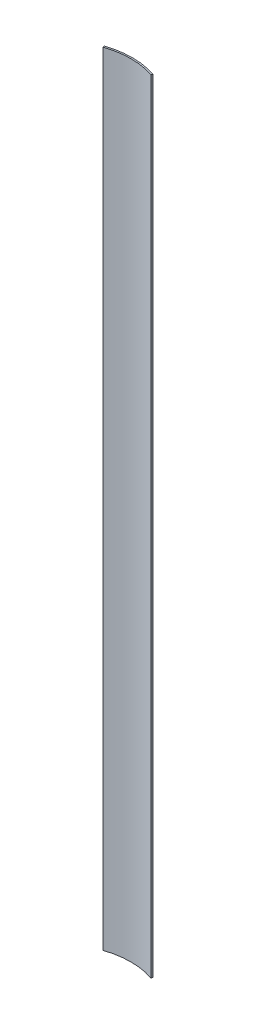
ISO-10303-21;
HEADER;
FILE_DESCRIPTION(('STEP AP214'),'2;1');
FILE_NAME('part.step','',(''),(''),'','','');
FILE_SCHEMA(('AUTOMOTIVE_DESIGN { 1 0 10303 214 1 1 1 1 }'));
ENDSEC;
DATA;
#1=APPLICATION_CONTEXT('core data for automotive mechanical design processes');
#2=APPLICATION_PROTOCOL_DEFINITION('international standard','automotive_design',2000,#1);
#3=PRODUCT_CONTEXT('',#1,'mechanical');
#4=PRODUCT('Part','Part','',(#3));
#5=PRODUCT_RELATED_PRODUCT_CATEGORY('part','',(#4));
#6=PRODUCT_DEFINITION_FORMATION('','',#4);
#7=PRODUCT_DEFINITION_CONTEXT('part definition',#1,'design');
#8=PRODUCT_DEFINITION('design','',#6,#7);
#9=PRODUCT_DEFINITION_SHAPE('','',#8);
#10=(LENGTH_UNIT() NAMED_UNIT(*) SI_UNIT(.MILLI.,.METRE.));
#11=(NAMED_UNIT(*) PLANE_ANGLE_UNIT() SI_UNIT($,.RADIAN.));
#12=(NAMED_UNIT(*) SI_UNIT($,.STERADIAN.) SOLID_ANGLE_UNIT());
#13=UNCERTAINTY_MEASURE_WITH_UNIT(LENGTH_MEASURE(1.E-05),#10,'distance_accuracy_value','');
#14=(GEOMETRIC_REPRESENTATION_CONTEXT(3) GLOBAL_UNCERTAINTY_ASSIGNED_CONTEXT((#13)) GLOBAL_UNIT_ASSIGNED_CONTEXT((#10,
#11,#12)) REPRESENTATION_CONTEXT('',''));
#15=CARTESIAN_POINT('',(0.,0.,0.));
#16=DIRECTION('',(0.,0.,1.));
#17=DIRECTION('',(1.,0.,0.));
#18=AXIS2_PLACEMENT_3D('',#15,#16,#17);
#19=CARTESIAN_POINT('',(0.,200.2,-6.83217682314223E-13));
#20=DIRECTION('',(0.,-1.,0.));
#21=DIRECTION('',(0.,0.,-1.));
#22=AXIS2_PLACEMENT_3D('',#19,#20,#21);
#23=PLANE('',#22);
#24=CARTESIAN_POINT('',(0.,200.2,-6.83217682314223E-13));
#25=DIRECTION('',(0.,-1.,0.));
#26=DIRECTION('',(0.,0.,-1.));
#27=AXIS2_PLACEMENT_3D('',#24,#25,#26);
#28=CIRCLE('',#27,19.45);
#29=CARTESIAN_POINT('',(-6.23779404858429,200.2,-18.4226063684668));
#30=VERTEX_POINT('',#29);
#31=CARTESIAN_POINT('',(6.23779404858429,200.2,-18.4226063684668));
#32=VERTEX_POINT('',#31);
#33=EDGE_CURVE('E76',#30,#32,#28,.T.);
#34=ORIENTED_EDGE('',*,*,#33,.F.);
#35=DIRECTION('',(-0.320709205582791,0.,-0.947177705319575));
#36=VECTOR('',#35,1.);
#37=CARTESIAN_POINT('',(-6.23779404858429,200.2,-18.4226063684668));
#38=LINE('',#37,#36);
#39=CARTESIAN_POINT('',(-6.10951036635117,200.2,-18.0437352863389));
#40=VERTEX_POINT('',#39);
#41=EDGE_CURVE('E64',#40,#30,#38,.T.);
#42=ORIENTED_EDGE('',*,*,#41,.F.);
#43=CARTESIAN_POINT('',(0.,200.2,-6.83217682314223E-13));
#44=DIRECTION('',(0.,1.,0.));
#45=DIRECTION('',(0.,0.,1.));
#46=AXIS2_PLACEMENT_3D('',#43,#44,#45);
#47=CIRCLE('',#46,19.05);
#48=CARTESIAN_POINT('',(6.10951036635118,200.2,-18.0437352863389));
#49=VERTEX_POINT('',#48);
#50=EDGE_CURVE('E69',#49,#40,#47,.T.);
#51=ORIENTED_EDGE('',*,*,#50,.F.);
#52=DIRECTION('',(-0.320709205582791,0.,0.947177705319575));
#53=VECTOR('',#52,1.);
#54=CARTESIAN_POINT('',(6.10951036635117,200.2,-18.0437352863389));
#55=LINE('',#54,#53);
#56=EDGE_CURVE('E73',#32,#49,#55,.T.);
#57=ORIENTED_EDGE('',*,*,#56,.F.);
#58=EDGE_LOOP('',(#34,#42,#51,#57));
#59=FACE_BOUND('',#58,.T.);
#60=ADVANCED_FACE('F34',(#59),#23,.F.);
#61=CARTESIAN_POINT('',(0.,0.,0.));
#62=DIRECTION('',(0.,-1.,0.));
#63=DIRECTION('',(0.,0.,-1.));
#64=AXIS2_PLACEMENT_3D('',#61,#62,#63);
#65=PLANE('',#64);
#66=CARTESIAN_POINT('',(0.,0.,0.));
#67=DIRECTION('',(0.,-1.,0.));
#68=DIRECTION('',(0.,0.,-1.));
#69=AXIS2_PLACEMENT_3D('',#66,#67,#68);
#70=CIRCLE('',#69,19.45);
#71=CARTESIAN_POINT('',(-6.23779404858429,0.,-18.4226063684661));
#72=VERTEX_POINT('',#71);
#73=CARTESIAN_POINT('',(6.23779404858429,0.,-18.4226063684661));
#74=VERTEX_POINT('',#73);
#75=EDGE_CURVE('E90',#72,#74,#70,.T.);
#76=ORIENTED_EDGE('',*,*,#75,.T.);
#77=DIRECTION('',(-0.320709205582791,0.,0.947177705319575));
#78=VECTOR('',#77,1.);
#79=CARTESIAN_POINT('',(6.10951036635117,0.,-18.0437352863382));
#80=LINE('',#79,#78);
#81=CARTESIAN_POINT('',(6.10951036635118,0.,-18.0437352863382));
#82=VERTEX_POINT('',#81);
#83=EDGE_CURVE('E53',#74,#82,#80,.T.);
#84=ORIENTED_EDGE('',*,*,#83,.T.);
#85=CARTESIAN_POINT('',(0.,0.,0.));
#86=DIRECTION('',(0.,1.,0.));
#87=DIRECTION('',(0.,0.,1.));
#88=AXIS2_PLACEMENT_3D('',#85,#86,#87);
#89=CIRCLE('',#88,19.05);
#90=CARTESIAN_POINT('',(-6.10951036635117,0.,-18.0437352863382));
#91=VERTEX_POINT('',#90);
#92=EDGE_CURVE('E47',#82,#91,#89,.T.);
#93=ORIENTED_EDGE('',*,*,#92,.T.);
#94=DIRECTION('',(-0.320709205582791,0.,-0.947177705319575));
#95=VECTOR('',#94,1.);
#96=CARTESIAN_POINT('',(-6.23779404858429,0.,-18.4226063684661));
#97=LINE('',#96,#95);
#98=EDGE_CURVE('E11',#91,#72,#97,.T.);
#99=ORIENTED_EDGE('',*,*,#98,.T.);
#100=EDGE_LOOP('',(#76,#84,#93,#99));
#101=FACE_BOUND('',#100,.T.);
#102=ADVANCED_FACE('F115',(#101),#65,.T.);
#103=CARTESIAN_POINT('',(0.,200.2,-6.83217682314223E-13));
#104=DIRECTION('',(0.,-1.,0.));
#105=DIRECTION('',(0.,0.,-1.));
#106=AXIS2_PLACEMENT_3D('',#103,#104,#105);
#107=CYLINDRICAL_SURFACE('',#106,19.45);
#108=DIRECTION('',(0.,-1.,0.));
#109=VECTOR('',#108,1.);
#110=CARTESIAN_POINT('',(6.23779404858429,200.2,-18.4226063684668));
#111=LINE('',#110,#109);
#112=EDGE_CURVE('E92',#32,#74,#111,.T.);
#113=ORIENTED_EDGE('',*,*,#112,.T.);
#114=ORIENTED_EDGE('',*,*,#75,.F.);
#115=DIRECTION('',(0.,-1.,0.));
#116=VECTOR('',#115,1.);
#117=CARTESIAN_POINT('',(-6.23779404858429,200.2,-18.4226063684668));
#118=LINE('',#117,#116);
#119=EDGE_CURVE('E86',#30,#72,#118,.T.);
#120=ORIENTED_EDGE('',*,*,#119,.F.);
#121=ORIENTED_EDGE('',*,*,#33,.T.);
#122=EDGE_LOOP('',(#113,#114,#120,#121));
#123=FACE_BOUND('',#122,.T.);
#124=ADVANCED_FACE('F89',(#123),#107,.T.);
#125=CARTESIAN_POINT('',(6.10951036635117,200.2,-18.0437352863389));
#126=DIRECTION('',(0.947177705319575,0.,0.320709205582791));
#127=DIRECTION('',(0.320709205582791,0.,-0.947177705319575));
#128=AXIS2_PLACEMENT_3D('',#125,#126,#127);
#129=PLANE('',#128);
#130=DIRECTION('',(0.,-1.,0.));
#131=VECTOR('',#130,1.);
#132=CARTESIAN_POINT('',(6.10951036635118,200.2,-18.0437352863389));
#133=LINE('',#132,#131);
#134=EDGE_CURVE('E98',#49,#82,#133,.T.);
#135=ORIENTED_EDGE('',*,*,#134,.T.);
#136=ORIENTED_EDGE('',*,*,#83,.F.);
#137=ORIENTED_EDGE('',*,*,#112,.F.);
#138=ORIENTED_EDGE('',*,*,#56,.T.);
#139=EDGE_LOOP('',(#135,#136,#137,#138));
#140=FACE_BOUND('',#139,.T.);
#141=ADVANCED_FACE('F107',(#140),#129,.T.);
#142=CARTESIAN_POINT('',(0.,200.2,-6.83217682314223E-13));
#143=DIRECTION('',(0.,-1.,0.));
#144=DIRECTION('',(0.,0.,-1.));
#145=AXIS2_PLACEMENT_3D('',#142,#143,#144);
#146=CYLINDRICAL_SURFACE('',#145,19.05);
#147=DIRECTION('',(0.,-1.,0.));
#148=VECTOR('',#147,1.);
#149=CARTESIAN_POINT('',(-6.10951036635117,200.2,-18.0437352863389));
#150=LINE('',#149,#148);
#151=EDGE_CURVE('E41',#40,#91,#150,.T.);
#152=ORIENTED_EDGE('',*,*,#151,.T.);
#153=ORIENTED_EDGE('',*,*,#92,.F.);
#154=ORIENTED_EDGE('',*,*,#134,.F.);
#155=ORIENTED_EDGE('',*,*,#50,.T.);
#156=EDGE_LOOP('',(#152,#153,#154,#155));
#157=FACE_BOUND('',#156,.T.);
#158=ADVANCED_FACE('F104',(#157),#146,.F.);
#159=CARTESIAN_POINT('',(-6.23779404858429,200.2,-18.4226063684668));
#160=DIRECTION('',(-0.947177705319575,0.,0.320709205582791));
#161=DIRECTION('',(0.320709205582791,0.,0.947177705319575));
#162=AXIS2_PLACEMENT_3D('',#159,#160,#161);
#163=PLANE('',#162);
#164=ORIENTED_EDGE('',*,*,#98,.F.);
#165=ORIENTED_EDGE('',*,*,#151,.F.);
#166=ORIENTED_EDGE('',*,*,#41,.T.);
#167=ORIENTED_EDGE('',*,*,#119,.T.);
#168=EDGE_LOOP('',(#164,#165,#166,#167));
#169=FACE_BOUND('',#168,.T.);
#170=ADVANCED_FACE('F85',(#169),#163,.T.);
#171=CLOSED_SHELL('',(#60,#102,#124,#141,#158,#170));
#172=MANIFOLD_SOLID_BREP('B2',#171);
#173=ADVANCED_BREP_SHAPE_REPRESENTATION('',(#18,#172),#14);
#174=SHAPE_DEFINITION_REPRESENTATION(#9,#173);
ENDSEC;
END-ISO-10303-21;
